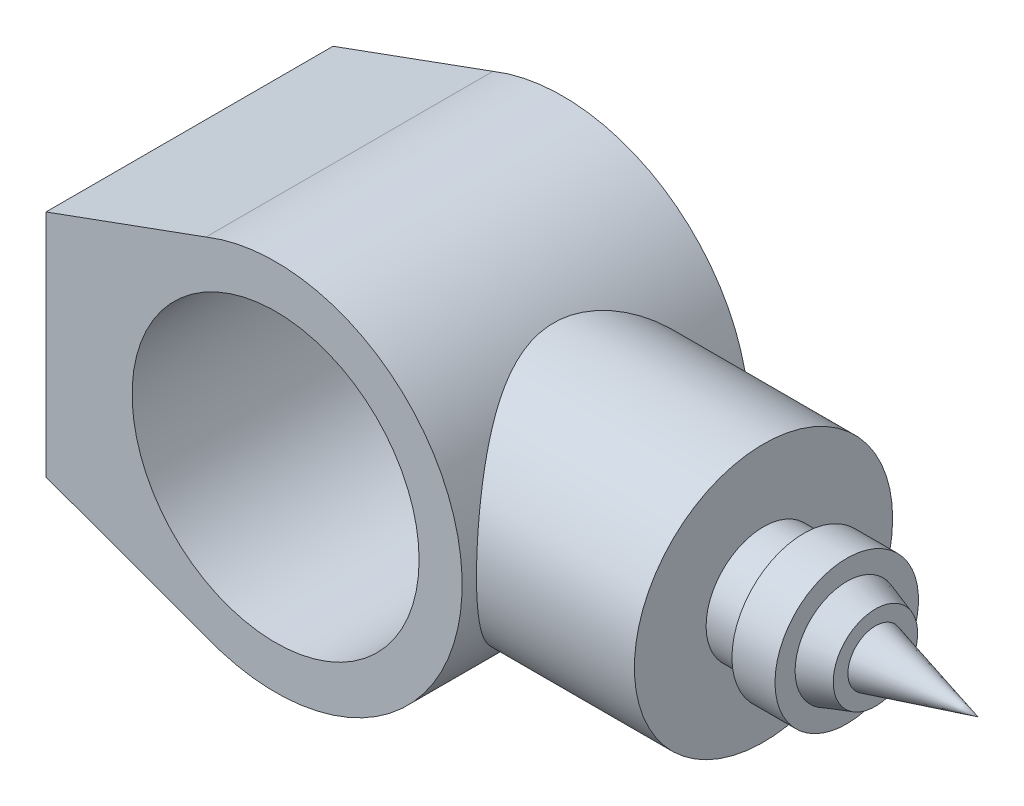
ISO-10303-21;
HEADER;
FILE_DESCRIPTION(('STEP AP214'),'2;1');
FILE_NAME('part.step','',(''),(''),'','','');
FILE_SCHEMA(('AUTOMOTIVE_DESIGN { 1 0 10303 214 1 1 1 1 }'));
ENDSEC;
DATA;
#1=APPLICATION_CONTEXT('core data for automotive mechanical design processes');
#2=APPLICATION_PROTOCOL_DEFINITION('international standard','automotive_design',2000,#1);
#3=PRODUCT_CONTEXT('',#1,'mechanical');
#4=PRODUCT('Part','Part','',(#3));
#5=PRODUCT_RELATED_PRODUCT_CATEGORY('part','',(#4));
#6=PRODUCT_DEFINITION_FORMATION('','',#4);
#7=PRODUCT_DEFINITION_CONTEXT('part definition',#1,'design');
#8=PRODUCT_DEFINITION('design','',#6,#7);
#9=PRODUCT_DEFINITION_SHAPE('','',#8);
#10=(LENGTH_UNIT() NAMED_UNIT(*) SI_UNIT(.MILLI.,.METRE.));
#11=(NAMED_UNIT(*) PLANE_ANGLE_UNIT() SI_UNIT($,.RADIAN.));
#12=(NAMED_UNIT(*) SI_UNIT($,.STERADIAN.) SOLID_ANGLE_UNIT());
#13=UNCERTAINTY_MEASURE_WITH_UNIT(LENGTH_MEASURE(1.E-05),#10,'distance_accuracy_value','');
#14=(GEOMETRIC_REPRESENTATION_CONTEXT(3) GLOBAL_UNCERTAINTY_ASSIGNED_CONTEXT((#13)) GLOBAL_UNIT_ASSIGNED_CONTEXT((#10,
#11,#12)) REPRESENTATION_CONTEXT('',''));
#15=CARTESIAN_POINT('',(0.,0.,0.));
#16=DIRECTION('',(0.,0.,1.));
#17=DIRECTION('',(1.,0.,0.));
#18=AXIS2_PLACEMENT_3D('',#15,#16,#17);
#19=CARTESIAN_POINT('',(0.,0.,50.));
#20=DIRECTION('',(0.,0.,1.));
#21=DIRECTION('',(1.,0.,0.));
#22=AXIS2_PLACEMENT_3D('',#19,#20,#21);
#23=PLANE('',#22);
#24=DIRECTION('',(-0.939609416161588,-0.342248659691283,0.));
#25=VECTOR('',#24,1.);
#26=CARTESIAN_POINT('',(-80.,40.,50.));
#27=LINE('',#26,#25);
#28=CARTESIAN_POINT('',(-24.2587212479378,60.3035193286001,50.));
#29=VERTEX_POINT('',#28);
#30=CARTESIAN_POINT('',(-80.,40.,50.));
#31=VERTEX_POINT('',#30);
#32=EDGE_CURVE('E186',#29,#31,#27,.T.);
#33=ORIENTED_EDGE('',*,*,#32,.T.);
#34=DIRECTION('',(0.,-1.,0.));
#35=VECTOR('',#34,1.);
#36=CARTESIAN_POINT('',(-80.,-40.,50.));
#37=LINE('',#36,#35);
#38=CARTESIAN_POINT('',(-80.,-40.,50.));
#39=VERTEX_POINT('',#38);
#40=EDGE_CURVE('E88',#31,#39,#37,.T.);
#41=ORIENTED_EDGE('',*,*,#40,.T.);
#42=DIRECTION('',(0.939609416161588,-0.342248659691283,0.));
#43=VECTOR('',#42,1.);
#44=CARTESIAN_POINT('',(-80.,-40.,50.));
#45=LINE('',#44,#43);
#46=CARTESIAN_POINT('',(-24.2587212479378,-60.3035193286001,50.));
#47=VERTEX_POINT('',#46);
#48=EDGE_CURVE('E182',#39,#47,#45,.T.);
#49=ORIENTED_EDGE('',*,*,#48,.T.);
#50=CARTESIAN_POINT('',(0.,0.,50.));
#51=DIRECTION('',(0.,0.,1.));
#52=DIRECTION('',(1.,0.,0.));
#53=AXIS2_PLACEMENT_3D('',#50,#51,#52);
#54=CIRCLE('',#53,65.);
#55=EDGE_CURVE('E57',#47,#29,#54,.T.);
#56=ORIENTED_EDGE('',*,*,#55,.T.);
#57=EDGE_LOOP('',(#33,#41,#49,#56));
#58=FACE_BOUND('',#57,.T.);
#59=CARTESIAN_POINT('',(0.,0.,50.));
#60=DIRECTION('',(0.,0.,1.));
#61=DIRECTION('',(1.,0.,0.));
#62=AXIS2_PLACEMENT_3D('',#59,#60,#61);
#63=CIRCLE('',#62,50.);
#64=CARTESIAN_POINT('',(50.,0.,50.));
#65=VERTEX_POINT('',#64);
#66=EDGE_CURVE('E196',#65,#65,#63,.T.);
#67=ORIENTED_EDGE('',*,*,#66,.F.);
#68=EDGE_LOOP('',(#67));
#69=FACE_BOUND('',#68,.T.);
#70=ADVANCED_FACE('F40',(#58,#69),#23,.T.);
#71=CARTESIAN_POINT('',(0.,0.,-50.));
#72=DIRECTION('',(0.,0.,1.));
#73=DIRECTION('',(1.,0.,0.));
#74=AXIS2_PLACEMENT_3D('',#71,#72,#73);
#75=PLANE('',#74);
#76=DIRECTION('',(-0.939609416161588,-0.342248659691283,0.));
#77=VECTOR('',#76,1.);
#78=CARTESIAN_POINT('',(-80.,40.,-50.));
#79=LINE('',#78,#77);
#80=CARTESIAN_POINT('',(-24.2587212479378,60.3035193286001,-50.));
#81=VERTEX_POINT('',#80);
#82=CARTESIAN_POINT('',(-80.,40.,-50.));
#83=VERTEX_POINT('',#82);
#84=EDGE_CURVE('E180',#81,#83,#79,.T.);
#85=ORIENTED_EDGE('',*,*,#84,.F.);
#86=CARTESIAN_POINT('',(0.,0.,-50.));
#87=DIRECTION('',(0.,0.,1.));
#88=DIRECTION('',(1.,0.,0.));
#89=AXIS2_PLACEMENT_3D('',#86,#87,#88);
#90=CIRCLE('',#89,65.);
#91=CARTESIAN_POINT('',(-24.2587212479378,-60.3035193286001,-50.));
#92=VERTEX_POINT('',#91);
#93=EDGE_CURVE('E81',#92,#81,#90,.T.);
#94=ORIENTED_EDGE('',*,*,#93,.F.);
#95=DIRECTION('',(0.939609416161588,-0.342248659691283,0.));
#96=VECTOR('',#95,1.);
#97=CARTESIAN_POINT('',(-80.,-40.,-50.));
#98=LINE('',#97,#96);
#99=CARTESIAN_POINT('',(-80.,-40.,-50.));
#100=VERTEX_POINT('',#99);
#101=EDGE_CURVE('E75',#100,#92,#98,.T.);
#102=ORIENTED_EDGE('',*,*,#101,.F.);
#103=DIRECTION('',(0.,-1.,0.));
#104=VECTOR('',#103,1.);
#105=CARTESIAN_POINT('',(-80.,-40.,-50.));
#106=LINE('',#105,#104);
#107=EDGE_CURVE('E175',#83,#100,#106,.T.);
#108=ORIENTED_EDGE('',*,*,#107,.F.);
#109=EDGE_LOOP('',(#85,#94,#102,#108));
#110=FACE_BOUND('',#109,.T.);
#111=CARTESIAN_POINT('',(0.,0.,-50.));
#112=DIRECTION('',(0.,0.,1.));
#113=DIRECTION('',(1.,0.,0.));
#114=AXIS2_PLACEMENT_3D('',#111,#112,#113);
#115=CIRCLE('',#114,50.);
#116=CARTESIAN_POINT('',(50.,0.,-50.));
#117=VERTEX_POINT('',#116);
#118=EDGE_CURVE('E198',#117,#117,#115,.T.);
#119=ORIENTED_EDGE('',*,*,#118,.T.);
#120=EDGE_LOOP('',(#119));
#121=FACE_BOUND('',#120,.T.);
#122=ADVANCED_FACE('F155',(#110,#121),#75,.F.);
#123=CARTESIAN_POINT('',(-80.,40.,50.));
#124=DIRECTION('',(0.342248659691283,-0.939609416161588,0.));
#125=DIRECTION('',(0.939609416161588,0.342248659691283,0.));
#126=AXIS2_PLACEMENT_3D('',#123,#124,#125);
#127=PLANE('',#126);
#128=ORIENTED_EDGE('',*,*,#84,.T.);
#129=DIRECTION('',(0.,0.,-1.));
#130=VECTOR('',#129,1.);
#131=CARTESIAN_POINT('',(-80.,40.,50.));
#132=LINE('',#131,#130);
#133=EDGE_CURVE('E11',#31,#83,#132,.T.);
#134=ORIENTED_EDGE('',*,*,#133,.F.);
#135=ORIENTED_EDGE('',*,*,#32,.F.);
#136=DIRECTION('',(0.,0.,-1.));
#137=VECTOR('',#136,1.);
#138=CARTESIAN_POINT('',(-24.2587212479378,60.3035193286001,50.));
#139=LINE('',#138,#137);
#140=EDGE_CURVE('E190',#29,#81,#139,.T.);
#141=ORIENTED_EDGE('',*,*,#140,.T.);
#142=EDGE_LOOP('',(#128,#134,#135,#141));
#143=FACE_BOUND('',#142,.T.);
#144=ADVANCED_FACE('F42',(#143),#127,.F.);
#145=CARTESIAN_POINT('',(-80.,-40.,50.));
#146=DIRECTION('',(1.,0.,0.));
#147=DIRECTION('',(0.,0.,-1.));
#148=AXIS2_PLACEMENT_3D('',#145,#146,#147);
#149=PLANE('',#148);
#150=ORIENTED_EDGE('',*,*,#107,.T.);
#151=DIRECTION('',(0.,0.,-1.));
#152=VECTOR('',#151,1.);
#153=CARTESIAN_POINT('',(-80.,-40.,50.));
#154=LINE('',#153,#152);
#155=EDGE_CURVE('E49',#39,#100,#154,.T.);
#156=ORIENTED_EDGE('',*,*,#155,.F.);
#157=ORIENTED_EDGE('',*,*,#40,.F.);
#158=ORIENTED_EDGE('',*,*,#133,.T.);
#159=EDGE_LOOP('',(#150,#156,#157,#158));
#160=FACE_BOUND('',#159,.T.);
#161=ADVANCED_FACE('F169',(#160),#149,.F.);
#162=CARTESIAN_POINT('',(-80.,-40.,50.));
#163=DIRECTION('',(0.342248659691283,0.939609416161588,0.));
#164=DIRECTION('',(-0.939609416161588,0.342248659691283,0.));
#165=AXIS2_PLACEMENT_3D('',#162,#163,#164);
#166=PLANE('',#165);
#167=ORIENTED_EDGE('',*,*,#101,.T.);
#168=DIRECTION('',(0.,0.,-1.));
#169=VECTOR('',#168,1.);
#170=CARTESIAN_POINT('',(-24.2587212479378,-60.3035193286001,50.));
#171=LINE('',#170,#169);
#172=EDGE_CURVE('E183',#47,#92,#171,.T.);
#173=ORIENTED_EDGE('',*,*,#172,.F.);
#174=ORIENTED_EDGE('',*,*,#48,.F.);
#175=ORIENTED_EDGE('',*,*,#155,.T.);
#176=EDGE_LOOP('',(#167,#173,#174,#175));
#177=FACE_BOUND('',#176,.T.);
#178=ADVANCED_FACE('F166',(#177),#166,.F.);
#179=CARTESIAN_POINT('',(0.,0.,50.));
#180=DIRECTION('',(0.,0.,-1.));
#181=DIRECTION('',(-1.,0.,0.));
#182=AXIS2_PLACEMENT_3D('',#179,#180,#181);
#183=CYLINDRICAL_SURFACE('',#182,65.);
#184=CARTESIAN_POINT('',(65.,0.,-45.));
#185=CARTESIAN_POINT('',(65.0000011696057,1.12147330120565,-45.0000012025283));
#186=CARTESIAN_POINT('',(64.9709159765212,2.24292945230778,-44.9580201602482));
#187=CARTESIAN_POINT('',(64.8553068641383,4.47658414079082,-44.790785609369));
#188=CARTESIAN_POINT('',(64.7687842573088,5.58878288911931,-44.6655340035371));
#189=CARTESIAN_POINT('',(64.5403785763001,7.79555151848628,-44.3336771879691));
#190=CARTESIAN_POINT('',(64.3984760503456,8.89011506447751,-44.1270433931238));
#191=CARTESIAN_POINT('',(64.0626457436966,11.0533096019768,-43.6354760134034));
#192=CARTESIAN_POINT('',(63.8687169569864,12.1219400915896,-43.3505409144375));
#193=CARTESIAN_POINT('',(63.4342222744662,14.2212125160505,-42.7078017297046));
#194=CARTESIAN_POINT('',(63.1938918545645,15.2520162370063,-42.3503651251477));
#195=CARTESIAN_POINT('',(62.6709259446924,17.2756280115286,-41.5659763086892));
#196=CARTESIAN_POINT('',(62.3882907364915,18.268436318107,-41.1390245597888));
#197=CARTESIAN_POINT('',(61.786108553932,20.2116697228795,-40.2199419970838));
#198=CARTESIAN_POINT('',(61.4665619062631,21.1620951960855,-39.7278117601444));
#199=CARTESIAN_POINT('',(60.7962171584065,23.0172309124314,-38.6825647509799));
#200=CARTESIAN_POINT('',(60.4454175300334,23.9219389167185,-38.1294449962195));
#201=CARTESIAN_POINT('',(59.6865648974474,25.7601880140228,-36.9151737617935));
#202=CARTESIAN_POINT('',(59.27618815402,26.6893215363404,-36.2488040005491));
#203=CARTESIAN_POINT('',(58.4330275057249,28.4880338622967,-34.8529502059224));
#204=CARTESIAN_POINT('',(58.0002425478181,29.3576098626539,-34.1234632053608));
#205=CARTESIAN_POINT('',(57.1195111836477,31.0364486388513,-32.6040251352403));
#206=CARTESIAN_POINT('',(56.6715447181891,31.8456267033451,-31.8139921794123));
#207=CARTESIAN_POINT('',(55.7691986061138,33.4006700551814,-30.1773036556993));
#208=CARTESIAN_POINT('',(55.3148185876119,34.1465316534289,-29.3306447936721));
#209=CARTESIAN_POINT('',(54.3303114345595,35.6959084068904,-27.4326466159468));
#210=CARTESIAN_POINT('',(53.8005937511269,36.4872853280241,-26.3711450656527));
#211=CARTESIAN_POINT('',(52.7593327891933,37.9773509509911,-24.17604025639));
#212=CARTESIAN_POINT('',(52.2477941160227,38.6760162868262,-23.0424189272517));
#213=CARTESIAN_POINT('',(51.2608149265043,39.9749077721744,-20.7072341856928));
#214=CARTESIAN_POINT('',(50.7853275075273,40.5752630453964,-19.5057627267967));
#215=CARTESIAN_POINT('',(49.8892399163793,41.6721166930025,-17.036931864064));
#216=CARTESIAN_POINT('',(49.4686114171658,42.1686687478853,-15.7696069409943));
#217=CARTESIAN_POINT('',(48.8208029416879,42.9149535309565,-13.5723996352816));
#218=CARTESIAN_POINT('',(48.5738420263557,43.1936925213245,-12.6581208440976));
#219=CARTESIAN_POINT('',(48.1238801744123,43.6944569649788,-10.8035389223551));
#220=CARTESIAN_POINT('',(47.9208721021929,43.9164916250901,-9.86324004407419));
#221=CARTESIAN_POINT('',(47.5660754926548,44.3005296261305,-7.96250438663409));
#222=CARTESIAN_POINT('',(47.4142038087044,44.4626304606427,-7.00210302149487));
#223=CARTESIAN_POINT('',(47.1671263845177,44.7246555122386,-5.06554052628518));
#224=CARTESIAN_POINT('',(47.0719206259529,44.824579749433,-4.08937940131224));
#225=CARTESIAN_POINT('',(46.9418899090943,44.9607388198673,-2.1232364847967));
#226=CARTESIAN_POINT('',(46.9073939345417,44.9966266570423,-1.13320851844658));
#227=CARTESIAN_POINT('',(46.9013571135476,45.0029190462422,0.847248377093852));
#228=CARTESIAN_POINT('',(46.9298161498631,44.9733237202183,1.837677305534));
#229=CARTESIAN_POINT('',(47.0484302849821,44.8492190899201,3.81128752429081));
#230=CARTESIAN_POINT('',(47.13862305521,44.7546701492421,4.79446401850661));
#231=CARTESIAN_POINT('',(47.3768313176079,44.5024241630868,6.74551496467455));
#232=CARTESIAN_POINT('',(47.5248480621437,44.3447257499009,7.71338908473168));
#233=CARTESIAN_POINT('',(47.8621764271841,43.9803320764262,9.56919366964684));
#234=CARTESIAN_POINT('',(48.0484149088864,43.7772163066585,10.4583970625519));
#235=CARTESIAN_POINT('',(48.4609441046406,43.32010640119,12.2144143492181));
#236=CARTESIAN_POINT('',(48.6872496045115,43.0660934784815,13.0812198417583));
#237=CARTESIAN_POINT('',(49.1738509640383,42.5096331932465,14.7898225666927));
#238=CARTESIAN_POINT('',(49.4341648638834,42.2071601049958,15.6316062329481));
#239=CARTESIAN_POINT('',(49.9825182796335,41.5563350032134,17.2876417419013));
#240=CARTESIAN_POINT('',(50.2705534011697,41.2079902580444,18.1018979206949));
#241=CARTESIAN_POINT('',(51.0225431471345,40.2767822129268,20.1137766396802));
#242=CARTESIAN_POINT('',(51.5007434523328,39.6654891440572,21.2930273345177));
#243=CARTESIAN_POINT('',(52.4891158781477,38.348029920852,23.5833678403921));
#244=CARTESIAN_POINT('',(52.9993005340589,37.6418264436726,24.6944305853524));
#245=CARTESIAN_POINT('',(54.0361557973494,36.1376496350166,26.8476775780095));
#246=CARTESIAN_POINT('',(54.5628535785461,35.3395185623559,27.8897384505711));
#247=CARTESIAN_POINT('',(55.6171804467178,33.6558443419671,29.8998791095632));
#248=CARTESIAN_POINT('',(56.1448094104418,32.7703120184234,30.8679680307498));
#249=CARTESIAN_POINT('',(57.1932449701135,30.9045304086319,32.7363921475659));
#250=CARTESIAN_POINT('',(57.7139191350983,29.9233731295192,33.6358963165067));
#251=CARTESIAN_POINT('',(58.7296419536465,27.8771206485979,35.350355349792));
#252=CARTESIAN_POINT('',(59.2246882700661,26.8120178135979,36.1653025097018));
#253=CARTESIAN_POINT('',(60.1756566955639,24.6035209522421,37.7024332048813));
#254=CARTESIAN_POINT('',(60.6316475651595,23.4602711709794,38.4247809320632));
#255=CARTESIAN_POINT('',(61.4931891608211,21.0989507187335,39.7703323765769));
#256=CARTESIAN_POINT('',(61.898755017873,19.8809026570889,40.3935658507715));
#257=CARTESIAN_POINT('',(62.5646802947783,17.6549035875762,41.4059204565395));
#258=CARTESIAN_POINT('',(62.8372982548467,16.6602403417733,41.8163120535009));
#259=CARTESIAN_POINT('',(63.3397164077328,14.6345031625144,42.5675669112335));
#260=CARTESIAN_POINT('',(63.569522535998,13.603434299959,42.9084398107234));
#261=CARTESIAN_POINT('',(63.9815049902596,11.5110112910016,43.5164676119118));
#262=CARTESIAN_POINT('',(64.1637052650743,10.4496726714621,43.7836595836378));
#263=CARTESIAN_POINT('',(64.476639865795,8.30296993183371,44.2409869387356));
#264=CARTESIAN_POINT('',(64.6073730982257,7.21760530180254,44.431120684921));
#265=CARTESIAN_POINT('',(64.8147345736682,5.02649787175023,44.7321113931983));
#266=CARTESIAN_POINT('',(64.8911534961694,3.92069290489763,44.8426616714377));
#267=CARTESIAN_POINT('',(64.9872183357685,1.70145350776208,44.981563734156));
#268=CARTESIAN_POINT('',(65.0068642771874,0.588019080747696,45.0099155538474));
#269=CARTESIAN_POINT('',(64.9889001241945,-1.63741781931566,44.9839662509349));
#270=CARTESIAN_POINT('',(64.9512898349751,-2.74942028747967,44.929664847113));
#271=CARTESIAN_POINT('',(64.819734418053,-4.96298947367603,44.7392747901952));
#272=CARTESIAN_POINT('',(64.7257910494465,-6.06455651648127,44.6031886909653));
#273=CARTESIAN_POINT('',(64.491175703309,-8.18254449212149,44.2620157992034));
#274=CARTESIAN_POINT('',(64.3536808680178,-9.20007959997774,44.0616107864454));
#275=CARTESIAN_POINT('',(64.0337856060908,-11.2121337136589,43.5930613516679));
#276=CARTESIAN_POINT('',(63.8513873855499,-12.2066538475799,43.3249202574929));
#277=CARTESIAN_POINT('',(63.4451725249075,-14.1673074608523,42.7239854011605));
#278=CARTESIAN_POINT('',(63.2213525684632,-15.1334386601223,42.3911864622047));
#279=CARTESIAN_POINT('',(62.736336352677,-17.0327019487273,41.6643868113868));
#280=CARTESIAN_POINT('',(62.4751380044848,-17.965832190203,41.2703826790343));
#281=CARTESIAN_POINT('',(61.8990085085122,-19.8637431772395,40.3931275129008));
#282=CARTESIAN_POINT('',(61.5815209528501,-20.8256806929253,39.9054081529014));
#283=CARTESIAN_POINT('',(60.9142086391395,-22.7035764997345,38.8677076181211));
#284=CARTESIAN_POINT('',(60.5643826081083,-23.6195329786528,38.3177239921568));
#285=CARTESIAN_POINT('',(59.8381347129401,-25.4032558353403,37.1592008079418));
#286=CARTESIAN_POINT('',(59.4616987975441,-26.270996314329,36.5506302507532));
#287=CARTESIAN_POINT('',(58.6884577670336,-27.9557544991496,35.2787474176625));
#288=CARTESIAN_POINT('',(58.2916515549571,-28.7727694681138,34.6154321925309));
#289=CARTESIAN_POINT('',(57.4151711853793,-30.4889708749912,33.1199200847161));
#290=CARTESIAN_POINT('',(56.9328754552547,-31.3785212006928,32.2781812569548));
#291=CARTESIAN_POINT('',(55.9590893109094,-33.0839042215169,30.5278352445589));
#292=CARTESIAN_POINT('',(55.4675975421249,-33.8997259516808,29.6192181500899));
#293=CARTESIAN_POINT('',(54.4860350387397,-35.45586994741,27.7375714933993));
#294=CARTESIAN_POINT('',(53.9959654596117,-36.1961418986443,26.7644997080007));
#295=CARTESIAN_POINT('',(53.0294834997435,-37.5978502361011,24.7568233036382));
#296=CARTESIAN_POINT('',(52.553069328415,-38.2592969946585,23.7222268074148));
#297=CARTESIAN_POINT('',(51.679941347726,-39.4291013564639,21.7149007388747));
#298=CARTESIAN_POINT('',(51.2803372484816,-39.9463152685162,20.7485884228094));
#299=CARTESIAN_POINT('',(50.5123974548912,-40.9130636661729,18.7705314851885));
#300=CARTESIAN_POINT('',(50.1440619804653,-41.3625976757848,17.7587865441704));
#301=CARTESIAN_POINT('',(49.4504928922364,-42.1893301292689,15.693797265063));
#302=CARTESIAN_POINT('',(49.1251906412473,-42.566644202947,14.6406225749502));
#303=CARTESIAN_POINT('',(48.5290098021012,-43.2451098617227,12.4950157035289));
#304=CARTESIAN_POINT('',(48.2581179989952,-43.5462799449171,11.4025931307277));
#305=CARTESIAN_POINT('',(47.8271610412375,-44.0186874861181,9.3921629994351));
#306=CARTESIAN_POINT('',(47.6558419905218,-44.2036946073207,8.47979353570419));
#307=CARTESIAN_POINT('',(47.3627606953031,-44.517583244497,6.63757582668245));
#308=CARTESIAN_POINT('',(47.2409923142224,-44.6464717105955,5.70772976070373));
#309=CARTESIAN_POINT('',(47.05166615705,-44.8459556683364,3.83718735816971));
#310=CARTESIAN_POINT('',(46.9840561376509,-44.9166073394187,2.89650236820514));
#311=CARTESIAN_POINT('',(46.9055698265682,-44.9985645522097,1.01014116515035));
#312=CARTESIAN_POINT('',(46.894694331428,-45.0098692606967,0.0644648821697862));
#313=CARTESIAN_POINT('',(46.9301408777119,-44.972908524549,-1.82506201386804));
#314=CARTESIAN_POINT('',(46.9764888551696,-44.9246160680299,-2.76891160474201));
#315=CARTESIAN_POINT('',(47.1245232303033,-44.7693052695385,-4.64731891289862));
#316=CARTESIAN_POINT('',(47.226209296244,-44.6622872796082,-5.58187668584874));
#317=CARTESIAN_POINT('',(47.4811423262629,-44.3911660407895,-7.43666598606561));
#318=CARTESIAN_POINT('',(47.634452919394,-44.2269923369625,-8.35687836049678));
#319=CARTESIAN_POINT('',(47.9871889035597,-43.8440109221367,-10.1768310643423));
#320=CARTESIAN_POINT('',(48.1866204648689,-43.6251959006593,-11.0765686368372));
#321=CARTESIAN_POINT('',(48.6908782922366,-43.0625185245671,-13.116726178063));
#322=CARTESIAN_POINT('',(49.0093972350599,-42.7008255731353,-14.2488681052183));
#323=CARTESIAN_POINT('',(49.699554494161,-41.8955268796886,-16.4668795226373));
#324=CARTESIAN_POINT('',(50.0712093704162,-41.4518955887103,-17.5527344499461));
#325=CARTESIAN_POINT('',(50.8544123719762,-40.4872212981013,-19.6760329984318));
#326=CARTESIAN_POINT('',(51.2660067549033,-39.9660881554129,-20.7134183727638));
#327=CARTESIAN_POINT('',(52.116211879306,-38.8508952329155,-22.7363587217865));
#328=CARTESIAN_POINT('',(52.5548209260535,-38.2568400254561,-23.7219169406072));
#329=CARTESIAN_POINT('',(53.4579357785502,-36.9847423381263,-25.6613286822633));
#330=CARTESIAN_POINT('',(53.9228021101371,-36.3051118639051,-26.6139712103077));
#331=CARTESIAN_POINT('',(54.8583333343946,-34.8753950985048,-28.4617532840731));
#332=CARTESIAN_POINT('',(55.3289982185488,-34.1253089107936,-29.3568929142368));
#333=CARTESIAN_POINT('',(56.2664339133503,-32.5564691651912,-31.0876310121466));
#334=CARTESIAN_POINT('',(56.7332035093429,-31.7376950080829,-31.923211478402));
#335=CARTESIAN_POINT('',(57.6535165855435,-30.033481652025,-33.5315189390535));
#336=CARTESIAN_POINT('',(58.1070588196762,-29.1480362003111,-34.3042400240121));
#337=CARTESIAN_POINT('',(59.0635284336244,-27.1643113596245,-35.9022819462667));
#338=CARTESIAN_POINT('',(59.5626106290919,-26.0547472869609,-36.7159606163356));
#339=CARTESIAN_POINT('',(60.5176757229357,-23.7521280348398,-38.2458641369291));
#340=CARTESIAN_POINT('',(60.9736519283074,-22.5590599397198,-38.962073861155));
#341=CARTESIAN_POINT('',(61.6149926579414,-20.7127348127311,-39.9558623322098));
#342=CARTESIAN_POINT('',(61.8215919655179,-20.088110583999,-40.2735888165198));
#343=CARTESIAN_POINT('',(62.2191547005856,-18.8206694867556,-40.8812436548858));
#344=CARTESIAN_POINT('',(62.4101203779565,-18.1778552539997,-41.1711760099034));
#345=CARTESIAN_POINT('',(62.7748527233683,-16.875283117665,-41.7219931318356));
#346=CARTESIAN_POINT('',(62.9486230408552,-16.2155288469421,-41.9828840638124));
#347=CARTESIAN_POINT('',(63.2775356475737,-14.8804011558233,-42.4744610119283));
#348=CARTESIAN_POINT('',(63.432679284421,-14.2050288695917,-42.7051492133046));
#349=CARTESIAN_POINT('',(63.8070721968101,-12.4447010544915,-43.25974494481));
#350=CARTESIAN_POINT('',(64.0114184468014,-11.3490405228654,-43.5602757498286));
#351=CARTESIAN_POINT('',(64.3654191982087,-9.12991345978806,-44.078827644396));
#352=CARTESIAN_POINT('',(64.5150820049425,-8.00645117856259,-44.2968612637911));
#353=CARTESIAN_POINT('',(64.7559993187061,-5.74082253729113,-44.6470112993716));
#354=CARTESIAN_POINT('',(64.847297757104,-4.59867091062173,-44.7791923387443));
#355=CARTESIAN_POINT('',(64.9692976296881,-2.30434018473195,-44.9556862638234));
#356=CARTESIAN_POINT('',(64.9999987983895,-1.15216104160189,-44.999998764566));
#357=CARTESIAN_POINT('',(65.,0.,-45.));
#358=B_SPLINE_CURVE_WITH_KNOTS('',3,(#184,#185,#186,#187,#188,#189,#190,#191,#192,#193,#194,
#195,#196,#197,#198,#199,#200,#201,#202,#203,#204,#205,#206,#207,#208,#209,#210,#211,#212,#213,
#214,#215,#216,#217,#218,#219,#220,#221,#222,#223,#224,#225,#226,#227,#228,#229,#230,#231,#232,
#233,#234,#235,#236,#237,#238,#239,#240,#241,#242,#243,#244,#245,#246,#247,#248,#249,#250,#251,
#252,#253,#254,#255,#256,#257,#258,#259,#260,#261,#262,#263,#264,#265,#266,#267,#268,#269,#270,
#271,#272,#273,#274,#275,#276,#277,#278,#279,#280,#281,#282,#283,#284,#285,#286,#287,#288,#289,
#290,#291,#292,#293,#294,#295,#296,#297,#298,#299,#300,#301,#302,#303,#304,#305,#306,#307,#308,
#309,#310,#311,#312,#313,#314,#315,#316,#317,#318,#319,#320,#321,#322,#323,#324,#325,#326,#327,
#328,#329,#330,#331,#332,#333,#334,#335,#336,#337,#338,#339,#340,#341,#342,#343,#344,#345,#346,
#347,#348,#349,#350,#351,#352,#353,#354,#355,#356,#357),.UNSPECIFIED.,.T.,.F.,(4,2,2,2,2,2,2,2,
2,2,2,2,2,2,2,2,2,2,2,2,2,2,2,2,2,2,2,2,2,2,2,2,2,2,2,2,2,2,2,2,2,2,2,2,2,2,2,2,2,2,2,2,2,2,2,2,
2,2,2,2,2,2,2,2,2,2,2,2,2,2,2,2,2,2,2,2,2,2,2,2,2,2,2,2,2,2,4),(0.,3.36323892794144,
6.72640100710137,10.0907454360665,13.4551549250109,16.8029195613731,20.1506619010729,
23.4983746134034,26.8462511096753,30.4871649037346,34.1282499524345,37.7743494260164,
41.4206611917409,45.6939383064405,49.9682903731881,54.2369825353392,58.5034617073671,
61.4625138492405,64.4210852373372,67.3748225577202,70.3285589227263,73.2982527376573,
76.2679410220407,79.2394430998938,82.2110095388412,85.0011411726389,87.7923045951578,
90.584954683776,93.3771628083065,97.6064034875675,101.837312178738,106.075592113262,
110.313347816192,114.596218662803,118.879479402292,123.155037051935,127.429308626693,
130.755998382163,134.082226580387,137.406778235214,140.731400520075,144.068767009318,
147.406132068879,150.743508483461,154.080780688207,157.215791533369,160.350648386749,
163.485756334407,166.621039552604,169.990545063149,173.360183268584,176.73161428665,
180.103227050672,184.047902440152,187.993163521895,191.94103513809,195.888386692538,
199.385185586645,202.88200907258,206.373186157811,209.863514294626,212.700365177753,
215.536864625513,218.370624567028,221.204424293963,224.039508887241,226.874576485218,
229.713151272815,232.55210603787,236.23803941247,239.925124033801,243.616531168718,
247.307706963636,251.081871120678,254.856029735252,258.631324277359,262.406973327354,
266.792058434818,271.177823293658,273.368885604935,275.55963203795,277.749912517597,
279.940034437727,283.398420446896,286.856280978073,290.31153567335,293.766805506531),.UNSPECIFIED.);
#359=CARTESIAN_POINT('',(65.,0.,-45.));
#360=VERTEX_POINT('',#359);
#361=EDGE_CURVE('E121',#360,#360,#358,.T.);
#362=ORIENTED_EDGE('',*,*,#361,.F.);
#363=EDGE_LOOP('',(#362));
#364=FACE_BOUND('',#363,.T.);
#365=ORIENTED_EDGE('',*,*,#93,.T.);
#366=ORIENTED_EDGE('',*,*,#140,.F.);
#367=ORIENTED_EDGE('',*,*,#55,.F.);
#368=ORIENTED_EDGE('',*,*,#172,.T.);
#369=EDGE_LOOP('',(#365,#366,#367,#368));
#370=FACE_BOUND('',#369,.T.);
#371=ADVANCED_FACE('F152',(#364,#370),#183,.T.);
#372=CARTESIAN_POINT('',(0.,0.,50.));
#373=DIRECTION('',(0.,0.,-1.));
#374=DIRECTION('',(-1.,0.,0.));
#375=AXIS2_PLACEMENT_3D('',#372,#373,#374);
#376=CYLINDRICAL_SURFACE('',#375,50.);
#377=ORIENTED_EDGE('',*,*,#66,.T.);
#378=EDGE_LOOP('',(#377));
#379=FACE_BOUND('',#378,.T.);
#380=ORIENTED_EDGE('',*,*,#118,.F.);
#381=EDGE_LOOP('',(#380));
#382=FACE_BOUND('',#381,.T.);
#383=ADVANCED_FACE('F142',(#379,#382),#376,.F.);
#384=CARTESIAN_POINT('',(-80.002,0.,0.));
#385=DIRECTION('',(1.,0.,0.));
#386=DIRECTION('',(0.,0.,-1.));
#387=AXIS2_PLACEMENT_3D('',#384,#385,#386);
#388=CYLINDRICAL_SURFACE('',#387,45.);
#389=CARTESIAN_POINT('',(120.,0.,0.));
#390=DIRECTION('',(1.,0.,0.));
#391=DIRECTION('',(0.,0.,-1.));
#392=AXIS2_PLACEMENT_3D('',#389,#390,#391);
#393=CIRCLE('',#392,45.);
#394=CARTESIAN_POINT('',(120.,0.,-45.));
#395=VERTEX_POINT('',#394);
#396=EDGE_CURVE('E129',#395,#395,#393,.T.);
#397=ORIENTED_EDGE('',*,*,#396,.F.);
#398=EDGE_LOOP('',(#397));
#399=FACE_BOUND('',#398,.T.);
#400=ORIENTED_EDGE('',*,*,#361,.T.);
#401=EDGE_LOOP('',(#400));
#402=FACE_BOUND('',#401,.T.);
#403=ADVANCED_FACE('F131',(#399,#402),#388,.T.);
#404=CARTESIAN_POINT('',(120.,0.,0.));
#405=DIRECTION('',(1.,0.,0.));
#406=DIRECTION('',(0.,0.,-1.));
#407=AXIS2_PLACEMENT_3D('',#404,#405,#406);
#408=PLANE('',#407);
#409=CARTESIAN_POINT('',(120.,0.,0.));
#410=DIRECTION('',(-1.,0.,0.));
#411=DIRECTION('',(0.,0.,1.));
#412=AXIS2_PLACEMENT_3D('',#409,#410,#411);
#413=CIRCLE('',#412,20.);
#414=CARTESIAN_POINT('',(120.,0.,20.));
#415=VERTEX_POINT('',#414);
#416=EDGE_CURVE('E118',#415,#415,#413,.T.);
#417=ORIENTED_EDGE('',*,*,#416,.T.);
#418=EDGE_LOOP('',(#417));
#419=FACE_BOUND('',#418,.T.);
#420=ORIENTED_EDGE('',*,*,#396,.T.);
#421=EDGE_LOOP('',(#420));
#422=FACE_BOUND('',#421,.T.);
#423=ADVANCED_FACE('F139',(#419,#422),#408,.T.);
#424=CARTESIAN_POINT('',(0.,0.,0.));
#425=DIRECTION('',(-1.,0.,0.));
#426=DIRECTION('',(0.,0.,1.));
#427=AXIS2_PLACEMENT_3D('',#424,#425,#426);
#428=CYLINDRICAL_SURFACE('',#427,20.);
#429=CARTESIAN_POINT('',(134.,0.,0.));
#430=DIRECTION('',(-1.,0.,0.));
#431=DIRECTION('',(0.,0.,1.));
#432=AXIS2_PLACEMENT_3D('',#429,#430,#431);
#433=CIRCLE('',#432,20.);
#434=CARTESIAN_POINT('',(134.,0.,20.));
#435=VERTEX_POINT('',#434);
#436=EDGE_CURVE('E115',#435,#435,#433,.T.);
#437=ORIENTED_EDGE('',*,*,#436,.T.);
#438=EDGE_LOOP('',(#437));
#439=FACE_BOUND('',#438,.T.);
#440=ORIENTED_EDGE('',*,*,#416,.F.);
#441=EDGE_LOOP('',(#440));
#442=FACE_BOUND('',#441,.T.);
#443=ADVANCED_FACE('F137',(#439,#442),#428,.T.);
#444=CARTESIAN_POINT('',(134.,-20.,0.));
#445=DIRECTION('',(-1.,0.,0.));
#446=DIRECTION('',(0.,0.,1.));
#447=AXIS2_PLACEMENT_3D('',#444,#445,#446);
#448=PLANE('',#447);
#449=CARTESIAN_POINT('',(134.,0.,0.));
#450=DIRECTION('',(-1.,0.,0.));
#451=DIRECTION('',(0.,0.,1.));
#452=AXIS2_PLACEMENT_3D('',#449,#450,#451);
#453=CIRCLE('',#452,25.);
#454=CARTESIAN_POINT('',(134.,0.,25.));
#455=VERTEX_POINT('',#454);
#456=EDGE_CURVE('E112',#455,#455,#453,.T.);
#457=ORIENTED_EDGE('',*,*,#456,.T.);
#458=EDGE_LOOP('',(#457));
#459=FACE_BOUND('',#458,.T.);
#460=ORIENTED_EDGE('',*,*,#436,.F.);
#461=EDGE_LOOP('',(#460));
#462=FACE_BOUND('',#461,.T.);
#463=ADVANCED_FACE('F147',(#459,#462),#448,.T.);
#464=CARTESIAN_POINT('',(0.,0.,0.));
#465=DIRECTION('',(-1.,0.,0.));
#466=DIRECTION('',(0.,0.,1.));
#467=AXIS2_PLACEMENT_3D('',#464,#465,#466);
#468=CYLINDRICAL_SURFACE('',#467,25.);
#469=CARTESIAN_POINT('',(149.,0.,0.));
#470=DIRECTION('',(-1.,0.,0.));
#471=DIRECTION('',(0.,0.,1.));
#472=AXIS2_PLACEMENT_3D('',#469,#470,#471);
#473=CIRCLE('',#472,25.);
#474=CARTESIAN_POINT('',(149.,0.,25.));
#475=VERTEX_POINT('',#474);
#476=EDGE_CURVE('E109',#475,#475,#473,.T.);
#477=ORIENTED_EDGE('',*,*,#476,.T.);
#478=EDGE_LOOP('',(#477));
#479=FACE_BOUND('',#478,.T.);
#480=ORIENTED_EDGE('',*,*,#456,.F.);
#481=EDGE_LOOP('',(#480));
#482=FACE_BOUND('',#481,.T.);
#483=ADVANCED_FACE('F266',(#479,#482),#468,.T.);
#484=CARTESIAN_POINT('',(149.,-25.,0.));
#485=DIRECTION('',(1.,0.,0.));
#486=DIRECTION('',(0.,0.,-1.));
#487=AXIS2_PLACEMENT_3D('',#484,#485,#486);
#488=PLANE('',#487);
#489=CARTESIAN_POINT('',(149.,0.,0.));
#490=DIRECTION('',(-1.,0.,0.));
#491=DIRECTION('',(0.,0.,1.));
#492=AXIS2_PLACEMENT_3D('',#489,#490,#491);
#493=CIRCLE('',#492,18.);
#494=CARTESIAN_POINT('',(149.,0.,18.));
#495=VERTEX_POINT('',#494);
#496=EDGE_CURVE('E104',#495,#495,#493,.T.);
#497=ORIENTED_EDGE('',*,*,#496,.T.);
#498=EDGE_LOOP('',(#497));
#499=FACE_BOUND('',#498,.T.);
#500=ORIENTED_EDGE('',*,*,#476,.F.);
#501=EDGE_LOOP('',(#500));
#502=FACE_BOUND('',#501,.T.);
#503=ADVANCED_FACE('F274',(#499,#502),#488,.T.);
#504=CARTESIAN_POINT('',(149.,0.,0.));
#505=DIRECTION('',(-1.,0.,0.));
#506=DIRECTION('',(0.,0.,1.));
#507=AXIS2_PLACEMENT_3D('',#504,#505,#506);
#508=CONICAL_SURFACE('',#507,18.,0.318627094204812);
#509=CARTESIAN_POINT('',(159.,0.,0.));
#510=DIRECTION('',(-1.,0.,0.));
#511=DIRECTION('',(0.,0.,1.));
#512=AXIS2_PLACEMENT_3D('',#509,#510,#511);
#513=CIRCLE('',#512,14.7013357967708);
#514=CARTESIAN_POINT('',(159.,0.,14.7013357967708));
#515=VERTEX_POINT('',#514);
#516=EDGE_CURVE('E101',#515,#515,#513,.T.);
#517=ORIENTED_EDGE('',*,*,#516,.T.);
#518=EDGE_LOOP('',(#517));
#519=FACE_BOUND('',#518,.T.);
#520=ORIENTED_EDGE('',*,*,#496,.F.);
#521=EDGE_LOOP('',(#520));
#522=FACE_BOUND('',#521,.T.);
#523=ADVANCED_FACE('F284',(#519,#522),#508,.T.);
#524=CARTESIAN_POINT('',(159.,-14.7013357967708,0.));
#525=DIRECTION('',(1.,0.,0.));
#526=DIRECTION('',(0.,0.,-1.));
#527=AXIS2_PLACEMENT_3D('',#524,#525,#526);
#528=PLANE('',#527);
#529=CARTESIAN_POINT('',(159.,0.,0.));
#530=DIRECTION('',(-1.,0.,0.));
#531=DIRECTION('',(0.,0.,1.));
#532=AXIS2_PLACEMENT_3D('',#529,#530,#531);
#533=CIRCLE('',#532,9.58840628176542);
#534=CARTESIAN_POINT('',(159.,0.,9.58840628176542));
#535=VERTEX_POINT('',#534);
#536=EDGE_CURVE('E99',#535,#535,#533,.T.);
#537=ORIENTED_EDGE('',*,*,#536,.T.);
#538=EDGE_LOOP('',(#537));
#539=FACE_BOUND('',#538,.T.);
#540=ORIENTED_EDGE('',*,*,#516,.F.);
#541=EDGE_LOOP('',(#540));
#542=FACE_BOUND('',#541,.T.);
#543=ADVANCED_FACE('F95',(#539,#542),#528,.T.);
#544=CARTESIAN_POINT('',(159.,0.,0.));
#545=DIRECTION('',(-1.,0.,0.));
#546=DIRECTION('',(0.,0.,1.));
#547=AXIS2_PLACEMENT_3D('',#544,#545,#546);
#548=CONICAL_SURFACE('',#547,9.58840628176542,0.262138011591059);
#549=CARTESIAN_POINT('',(194.736010759118,0.,0.));
#550=VERTEX_POINT('',#549);
#551=VERTEX_LOOP('',#550);
#552=FACE_BOUND('',#551,.T.);
#553=ORIENTED_EDGE('',*,*,#536,.F.);
#554=EDGE_LOOP('',(#553));
#555=FACE_BOUND('',#554,.T.);
#556=ADVANCED_FACE('F92',(#552,#555),#548,.T.);
#557=CLOSED_SHELL('',(#70,#122,#144,#161,#178,#371,#383,#403,#423,#443,#463,#483,#503,#523,#543,#556));
#558=MANIFOLD_SOLID_BREP('B2',#557);
#559=ADVANCED_BREP_SHAPE_REPRESENTATION('',(#18,#558),#14);
#560=SHAPE_DEFINITION_REPRESENTATION(#9,#559);
ENDSEC;
END-ISO-10303-21;
